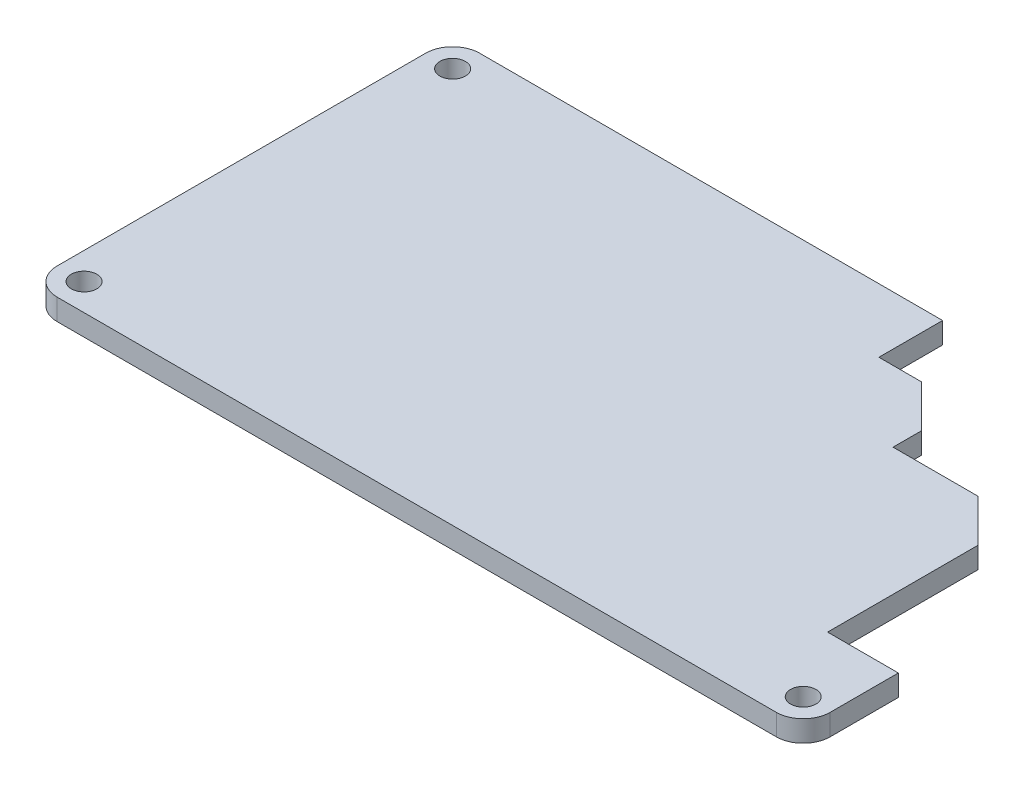
ISO-10303-21;
HEADER;
FILE_DESCRIPTION(('STEP AP214'),'2;1');
FILE_NAME('part.step','',(''),(''),'','','');
FILE_SCHEMA(('AUTOMOTIVE_DESIGN { 1 0 10303 214 1 1 1 1 }'));
ENDSEC;
DATA;
#1=APPLICATION_CONTEXT('core data for automotive mechanical design processes');
#2=APPLICATION_PROTOCOL_DEFINITION('international standard','automotive_design',2000,#1);
#3=PRODUCT_CONTEXT('',#1,'mechanical');
#4=PRODUCT('Part','Part','',(#3));
#5=PRODUCT_RELATED_PRODUCT_CATEGORY('part','',(#4));
#6=PRODUCT_DEFINITION_FORMATION('','',#4);
#7=PRODUCT_DEFINITION_CONTEXT('part definition',#1,'design');
#8=PRODUCT_DEFINITION('design','',#6,#7);
#9=PRODUCT_DEFINITION_SHAPE('','',#8);
#10=(LENGTH_UNIT() NAMED_UNIT(*) SI_UNIT(.MILLI.,.METRE.));
#11=(NAMED_UNIT(*) PLANE_ANGLE_UNIT() SI_UNIT($,.RADIAN.));
#12=(NAMED_UNIT(*) SI_UNIT($,.STERADIAN.) SOLID_ANGLE_UNIT());
#13=UNCERTAINTY_MEASURE_WITH_UNIT(LENGTH_MEASURE(1.E-05),#10,'distance_accuracy_value','');
#14=(GEOMETRIC_REPRESENTATION_CONTEXT(3) GLOBAL_UNCERTAINTY_ASSIGNED_CONTEXT((#13)) GLOBAL_UNIT_ASSIGNED_CONTEXT((#10,
#11,#12)) REPRESENTATION_CONTEXT('',''));
#15=CARTESIAN_POINT('',(0.,0.,0.));
#16=DIRECTION('',(0.,0.,1.));
#17=DIRECTION('',(1.,0.,0.));
#18=AXIS2_PLACEMENT_3D('',#15,#16,#17);
#19=CARTESIAN_POINT('',(0.,3.,-29.844983489967));
#20=DIRECTION('',(0.,0.,1.));
#21=DIRECTION('',(1.,0.,0.));
#22=AXIS2_PLACEMENT_3D('',#19,#20,#21);
#23=PLANE('',#22);
#24=DIRECTION('',(-1.,0.,0.));
#25=VECTOR('',#24,1.);
#26=CARTESIAN_POINT('',(0.,0.,-29.844983489967));
#27=LINE('',#26,#25);
#28=CARTESIAN_POINT('',(14.6100076200153,0.,-29.844983489967));
#29=VERTEX_POINT('',#28);
#30=CARTESIAN_POINT('',(-50.7999999999999,0.,-29.844983489967));
#31=VERTEX_POINT('',#30);
#32=EDGE_CURVE('E167',#29,#31,#27,.T.);
#33=ORIENTED_EDGE('',*,*,#32,.T.);
#34=DIRECTION('',(0.,-1.,0.));
#35=VECTOR('',#34,1.);
#36=CARTESIAN_POINT('',(-50.7999999999999,3.,-29.844983489967));
#37=LINE('',#36,#35);
#38=CARTESIAN_POINT('',(-50.7999999999999,3.,-29.844983489967));
#39=VERTEX_POINT('',#38);
#40=EDGE_CURVE('E150',#39,#31,#37,.T.);
#41=ORIENTED_EDGE('',*,*,#40,.F.);
#42=DIRECTION('',(-1.,0.,0.));
#43=VECTOR('',#42,1.);
#44=CARTESIAN_POINT('',(0.,3.,-29.844983489967));
#45=LINE('',#44,#43);
#46=CARTESIAN_POINT('',(14.6100076200153,3.,-29.844983489967));
#47=VERTEX_POINT('',#46);
#48=EDGE_CURVE('E155',#47,#39,#45,.T.);
#49=ORIENTED_EDGE('',*,*,#48,.F.);
#50=DIRECTION('',(0.,-1.,0.));
#51=VECTOR('',#50,1.);
#52=CARTESIAN_POINT('',(14.6100076200153,3.,-29.844983489967));
#53=LINE('',#52,#51);
#54=EDGE_CURVE('E239',#47,#29,#53,.T.);
#55=ORIENTED_EDGE('',*,*,#54,.T.);
#56=EDGE_LOOP('',(#33,#41,#49,#55));
#57=FACE_BOUND('',#56,.T.);
#58=ADVANCED_FACE('F36',(#57),#23,.F.);
#59=CARTESIAN_POINT('',(-50.7999999999999,3.,-26.0350012700026));
#60=DIRECTION('',(0.,-1.,0.));
#61=DIRECTION('',(0.,0.,-1.));
#62=AXIS2_PLACEMENT_3D('',#59,#60,#61);
#63=CYLINDRICAL_SURFACE('',#62,3.80998221996446);
#64=CARTESIAN_POINT('',(-50.7999999999999,0.,-26.0350012700026));
#65=DIRECTION('',(0.,1.,0.));
#66=DIRECTION('',(0.,0.,1.));
#67=AXIS2_PLACEMENT_3D('',#64,#65,#66);
#68=CIRCLE('',#67,3.80998221996446);
#69=CARTESIAN_POINT('',(-54.6099822199644,0.,-26.0350012700026));
#70=VERTEX_POINT('',#69);
#71=EDGE_CURVE('E216',#31,#70,#68,.T.);
#72=ORIENTED_EDGE('',*,*,#71,.T.);
#73=DIRECTION('',(0.,-1.,0.));
#74=VECTOR('',#73,1.);
#75=CARTESIAN_POINT('',(-54.6099822199644,3.,-26.0350012700026));
#76=LINE('',#75,#74);
#77=CARTESIAN_POINT('',(-54.6099822199644,3.,-26.0350012700026));
#78=VERTEX_POINT('',#77);
#79=EDGE_CURVE('E153',#78,#70,#76,.T.);
#80=ORIENTED_EDGE('',*,*,#79,.F.);
#81=CARTESIAN_POINT('',(-50.7999999999999,3.,-26.0350012700026));
#82=DIRECTION('',(0.,1.,0.));
#83=DIRECTION('',(0.,0.,1.));
#84=AXIS2_PLACEMENT_3D('',#81,#82,#83);
#85=CIRCLE('',#84,3.80998221996446);
#86=EDGE_CURVE('E145',#39,#78,#85,.T.);
#87=ORIENTED_EDGE('',*,*,#86,.F.);
#88=ORIENTED_EDGE('',*,*,#40,.T.);
#89=EDGE_LOOP('',(#72,#80,#87,#88));
#90=FACE_BOUND('',#89,.T.);
#91=ADVANCED_FACE('F148',(#90),#63,.T.);
#92=CARTESIAN_POINT('',(-54.6099822199644,3.,0.));
#93=DIRECTION('',(-1.,0.,0.));
#94=DIRECTION('',(0.,0.,1.));
#95=AXIS2_PLACEMENT_3D('',#92,#93,#94);
#96=PLANE('',#95);
#97=DIRECTION('',(0.,0.,-1.));
#98=VECTOR('',#97,1.);
#99=CARTESIAN_POINT('',(-54.6099822199644,0.,0.));
#100=LINE('',#99,#98);
#101=CARTESIAN_POINT('',(-54.6099822199644,0.,26.0349834899669));
#102=VERTEX_POINT('',#101);
#103=EDGE_CURVE('E212',#102,#70,#100,.T.);
#104=ORIENTED_EDGE('',*,*,#103,.F.);
#105=DIRECTION('',(0.,-1.,0.));
#106=VECTOR('',#105,1.);
#107=CARTESIAN_POINT('',(-54.6099822199644,3.,26.0349834899669));
#108=LINE('',#107,#106);
#109=CARTESIAN_POINT('',(-54.6099822199644,3.,26.0349834899669));
#110=VERTEX_POINT('',#109);
#111=EDGE_CURVE('E11',#102,#110,#108,.F.);
#112=ORIENTED_EDGE('',*,*,#111,.T.);
#113=DIRECTION('',(0.,0.,-1.));
#114=VECTOR('',#113,1.);
#115=CARTESIAN_POINT('',(-54.6099822199644,3.,0.));
#116=LINE('',#115,#114);
#117=EDGE_CURVE('E154',#110,#78,#116,.T.);
#118=ORIENTED_EDGE('',*,*,#117,.T.);
#119=ORIENTED_EDGE('',*,*,#79,.T.);
#120=EDGE_LOOP('',(#104,#112,#118,#119));
#121=FACE_BOUND('',#120,.T.);
#122=ADVANCED_FACE('F287',(#121),#96,.T.);
#123=CARTESIAN_POINT('',(0.,3.,29.8449834899669));
#124=DIRECTION('',(0.,0.,1.));
#125=DIRECTION('',(1.,0.,0.));
#126=AXIS2_PLACEMENT_3D('',#123,#124,#125);
#127=PLANE('',#126);
#128=DIRECTION('',(-1.,0.,0.));
#129=VECTOR('',#128,1.);
#130=CARTESIAN_POINT('',(0.,0.,29.8449834899669));
#131=LINE('',#130,#129);
#132=CARTESIAN_POINT('',(50.7999822199644,0.,29.8449834899669));
#133=VERTEX_POINT('',#132);
#134=CARTESIAN_POINT('',(-50.7999822199644,0.,29.8449834899669));
#135=VERTEX_POINT('',#134);
#136=EDGE_CURVE('E206',#133,#135,#131,.T.);
#137=ORIENTED_EDGE('',*,*,#136,.F.);
#138=DIRECTION('',(0.,-1.,0.));
#139=VECTOR('',#138,1.);
#140=CARTESIAN_POINT('',(50.7999822199644,3.,29.8449834899669));
#141=LINE('',#140,#139);
#142=CARTESIAN_POINT('',(50.7999822199644,3.,29.8449834899669));
#143=VERTEX_POINT('',#142);
#144=EDGE_CURVE('E183',#133,#143,#141,.F.);
#145=ORIENTED_EDGE('',*,*,#144,.T.);
#146=DIRECTION('',(-1.,0.,0.));
#147=VECTOR('',#146,1.);
#148=CARTESIAN_POINT('',(0.,3.,29.8449834899669));
#149=LINE('',#148,#147);
#150=CARTESIAN_POINT('',(-50.7999822199644,3.,29.8449834899669));
#151=VERTEX_POINT('',#150);
#152=EDGE_CURVE('E190',#143,#151,#149,.T.);
#153=ORIENTED_EDGE('',*,*,#152,.T.);
#154=DIRECTION('',(0.,-1.,0.));
#155=VECTOR('',#154,1.);
#156=CARTESIAN_POINT('',(-50.7999822199644,3.,29.8449834899669));
#157=LINE('',#156,#155);
#158=EDGE_CURVE('E180',#151,#135,#157,.T.);
#159=ORIENTED_EDGE('',*,*,#158,.T.);
#160=EDGE_LOOP('',(#137,#145,#153,#159));
#161=FACE_BOUND('',#160,.T.);
#162=ADVANCED_FACE('F210',(#161),#127,.T.);
#163=CARTESIAN_POINT('',(54.6099822199644,3.,0.));
#164=DIRECTION('',(-1.,0.,0.));
#165=DIRECTION('',(0.,0.,1.));
#166=AXIS2_PLACEMENT_3D('',#163,#164,#165);
#167=PLANE('',#166);
#168=DIRECTION('',(0.,0.,-1.));
#169=VECTOR('',#168,1.);
#170=CARTESIAN_POINT('',(54.6099822199644,3.,0.));
#171=LINE('',#170,#169);
#172=CARTESIAN_POINT('',(54.6099822199644,3.,26.0349834899669));
#173=VERTEX_POINT('',#172);
#174=CARTESIAN_POINT('',(54.6099822199644,3.,16.4073153565341));
#175=VERTEX_POINT('',#174);
#176=EDGE_CURVE('E188',#173,#175,#171,.T.);
#177=ORIENTED_EDGE('',*,*,#176,.F.);
#178=DIRECTION('',(0.,-1.,0.));
#179=VECTOR('',#178,1.);
#180=CARTESIAN_POINT('',(54.6099822199644,0.,26.0349834899669));
#181=LINE('',#180,#179);
#182=CARTESIAN_POINT('',(54.6099822199644,0.,26.0349834899669));
#183=VERTEX_POINT('',#182);
#184=EDGE_CURVE('E168',#173,#183,#181,.T.);
#185=ORIENTED_EDGE('',*,*,#184,.T.);
#186=DIRECTION('',(0.,0.,-1.));
#187=VECTOR('',#186,1.);
#188=CARTESIAN_POINT('',(54.6099822199644,0.,0.));
#189=LINE('',#188,#187);
#190=CARTESIAN_POINT('',(54.6099822199644,0.,16.4073153565341));
#191=VERTEX_POINT('',#190);
#192=EDGE_CURVE('E208',#183,#191,#189,.T.);
#193=ORIENTED_EDGE('',*,*,#192,.T.);
#194=DIRECTION('',(0.,-1.,0.));
#195=VECTOR('',#194,1.);
#196=CARTESIAN_POINT('',(54.6099822199644,3.,16.4073153565341));
#197=LINE('',#196,#195);
#198=EDGE_CURVE('E173',#175,#191,#197,.T.);
#199=ORIENTED_EDGE('',*,*,#198,.F.);
#200=EDGE_LOOP('',(#177,#185,#193,#199));
#201=FACE_BOUND('',#200,.T.);
#202=ADVANCED_FACE('F195',(#201),#167,.F.);
#203=CARTESIAN_POINT('',(0.,3.,16.4073153565341));
#204=DIRECTION('',(0.,0.,1.));
#205=DIRECTION('',(1.,0.,0.));
#206=AXIS2_PLACEMENT_3D('',#203,#204,#205);
#207=PLANE('',#206);
#208=DIRECTION('',(-1.,0.,0.));
#209=VECTOR('',#208,1.);
#210=CARTESIAN_POINT('',(0.,0.,16.4073153565341));
#211=LINE('',#210,#209);
#212=CARTESIAN_POINT('',(44.6100076200153,0.,16.4073153565341));
#213=VERTEX_POINT('',#212);
#214=EDGE_CURVE('E214',#191,#213,#211,.T.);
#215=ORIENTED_EDGE('',*,*,#214,.T.);
#216=DIRECTION('',(0.,-1.,0.));
#217=VECTOR('',#216,1.);
#218=CARTESIAN_POINT('',(44.6100076200153,3.,16.4073153565341));
#219=LINE('',#218,#217);
#220=CARTESIAN_POINT('',(44.6100076200153,3.,16.4073153565341));
#221=VERTEX_POINT('',#220);
#222=EDGE_CURVE('E254',#221,#213,#219,.T.);
#223=ORIENTED_EDGE('',*,*,#222,.F.);
#224=DIRECTION('',(-1.,0.,0.));
#225=VECTOR('',#224,1.);
#226=CARTESIAN_POINT('',(0.,3.,16.4073153565341));
#227=LINE('',#226,#225);
#228=EDGE_CURVE('E199',#175,#221,#227,.T.);
#229=ORIENTED_EDGE('',*,*,#228,.F.);
#230=ORIENTED_EDGE('',*,*,#198,.T.);
#231=EDGE_LOOP('',(#215,#223,#229,#230));
#232=FACE_BOUND('',#231,.T.);
#233=ADVANCED_FACE('F257',(#232),#207,.F.);
#234=CARTESIAN_POINT('',(44.6100076200153,3.,0.));
#235=DIRECTION('',(-1.,0.,0.));
#236=DIRECTION('',(0.,0.,1.));
#237=AXIS2_PLACEMENT_3D('',#234,#235,#236);
#238=PLANE('',#237);
#239=DIRECTION('',(0.,0.,-1.));
#240=VECTOR('',#239,1.);
#241=CARTESIAN_POINT('',(44.6100076200153,0.,0.));
#242=LINE('',#241,#240);
#243=CARTESIAN_POINT('',(44.6100076200153,0.,-4.84498348996696));
#244=VERTEX_POINT('',#243);
#245=EDGE_CURVE('E221',#213,#244,#242,.T.);
#246=ORIENTED_EDGE('',*,*,#245,.T.);
#247=DIRECTION('',(0.,-1.,0.));
#248=VECTOR('',#247,1.);
#249=CARTESIAN_POINT('',(44.6100076200153,3.,-4.84498348996696));
#250=LINE('',#249,#248);
#251=CARTESIAN_POINT('',(44.6100076200153,3.,-4.84498348996696));
#252=VERTEX_POINT('',#251);
#253=EDGE_CURVE('E252',#252,#244,#250,.T.);
#254=ORIENTED_EDGE('',*,*,#253,.F.);
#255=DIRECTION('',(0.,0.,-1.));
#256=VECTOR('',#255,1.);
#257=CARTESIAN_POINT('',(44.6100076200153,3.,0.));
#258=LINE('',#257,#256);
#259=EDGE_CURVE('E266',#221,#252,#258,.T.);
#260=ORIENTED_EDGE('',*,*,#259,.F.);
#261=ORIENTED_EDGE('',*,*,#222,.T.);
#262=EDGE_LOOP('',(#246,#254,#260,#261));
#263=FACE_BOUND('',#262,.T.);
#264=ADVANCED_FACE('F263',(#263),#238,.F.);
#265=CARTESIAN_POINT('',(24.7274955549911,3.,-24.7274955549911));
#266=DIRECTION('',(0.707106781186548,0.,-0.707106781186547));
#267=DIRECTION('',(-0.707106781186547,0.,-0.707106781186548));
#268=AXIS2_PLACEMENT_3D('',#265,#266,#267);
#269=PLANE('',#268);
#270=DIRECTION('',(0.707106781186547,0.,0.707106781186548));
#271=VECTOR('',#270,1.);
#272=CARTESIAN_POINT('',(24.7274955549911,0.,-24.7274955549911));
#273=LINE('',#272,#271);
#274=CARTESIAN_POINT('',(38.6100076200153,0.,-10.844983489967));
#275=VERTEX_POINT('',#274);
#276=EDGE_CURVE('E224',#275,#244,#273,.T.);
#277=ORIENTED_EDGE('',*,*,#276,.F.);
#278=DIRECTION('',(0.,-1.,0.));
#279=VECTOR('',#278,1.);
#280=CARTESIAN_POINT('',(38.6100076200153,3.,-10.844983489967));
#281=LINE('',#280,#279);
#282=CARTESIAN_POINT('',(38.6100076200153,3.,-10.844983489967));
#283=VERTEX_POINT('',#282);
#284=EDGE_CURVE('E250',#283,#275,#281,.T.);
#285=ORIENTED_EDGE('',*,*,#284,.F.);
#286=DIRECTION('',(0.707106781186547,0.,0.707106781186548));
#287=VECTOR('',#286,1.);
#288=CARTESIAN_POINT('',(24.7274955549911,3.,-24.7274955549911));
#289=LINE('',#288,#287);
#290=EDGE_CURVE('E268',#283,#252,#289,.T.);
#291=ORIENTED_EDGE('',*,*,#290,.T.);
#292=ORIENTED_EDGE('',*,*,#253,.T.);
#293=EDGE_LOOP('',(#277,#285,#291,#292));
#294=FACE_BOUND('',#293,.T.);
#295=ADVANCED_FACE('F361',(#294),#269,.T.);
#296=CARTESIAN_POINT('',(0.,3.,-10.844983489967));
#297=DIRECTION('',(0.,0.,-1.));
#298=DIRECTION('',(-1.,0.,0.));
#299=AXIS2_PLACEMENT_3D('',#296,#297,#298);
#300=PLANE('',#299);
#301=DIRECTION('',(1.,0.,0.));
#302=VECTOR('',#301,1.);
#303=CARTESIAN_POINT('',(0.,0.,-10.844983489967));
#304=LINE('',#303,#302);
#305=CARTESIAN_POINT('',(26.6100076200153,0.,-10.844983489967));
#306=VERTEX_POINT('',#305);
#307=EDGE_CURVE('E227',#306,#275,#304,.T.);
#308=ORIENTED_EDGE('',*,*,#307,.F.);
#309=DIRECTION('',(0.,-1.,0.));
#310=VECTOR('',#309,1.);
#311=CARTESIAN_POINT('',(26.6100076200153,3.,-10.844983489967));
#312=LINE('',#311,#310);
#313=CARTESIAN_POINT('',(26.6100076200153,3.,-10.844983489967));
#314=VERTEX_POINT('',#313);
#315=EDGE_CURVE('E248',#314,#306,#312,.T.);
#316=ORIENTED_EDGE('',*,*,#315,.F.);
#317=DIRECTION('',(1.,0.,0.));
#318=VECTOR('',#317,1.);
#319=CARTESIAN_POINT('',(0.,3.,-10.844983489967));
#320=LINE('',#319,#318);
#321=EDGE_CURVE('E270',#314,#283,#320,.T.);
#322=ORIENTED_EDGE('',*,*,#321,.T.);
#323=ORIENTED_EDGE('',*,*,#284,.T.);
#324=EDGE_LOOP('',(#308,#316,#322,#323));
#325=FACE_BOUND('',#324,.T.);
#326=ADVANCED_FACE('F357',(#325),#300,.T.);
#327=CARTESIAN_POINT('',(26.6100076200153,3.,0.));
#328=DIRECTION('',(1.,0.,0.));
#329=DIRECTION('',(0.,0.,-1.));
#330=AXIS2_PLACEMENT_3D('',#327,#328,#329);
#331=PLANE('',#330);
#332=DIRECTION('',(0.,0.,1.));
#333=VECTOR('',#332,1.);
#334=CARTESIAN_POINT('',(26.6100076200153,0.,0.));
#335=LINE('',#334,#333);
#336=CARTESIAN_POINT('',(26.6100076200153,0.,-14.844983489967));
#337=VERTEX_POINT('',#336);
#338=EDGE_CURVE('E230',#337,#306,#335,.T.);
#339=ORIENTED_EDGE('',*,*,#338,.F.);
#340=DIRECTION('',(0.,-1.,0.));
#341=VECTOR('',#340,1.);
#342=CARTESIAN_POINT('',(26.6100076200153,3.,-14.844983489967));
#343=LINE('',#342,#341);
#344=CARTESIAN_POINT('',(26.6100076200153,3.,-14.844983489967));
#345=VERTEX_POINT('',#344);
#346=EDGE_CURVE('E246',#345,#337,#343,.T.);
#347=ORIENTED_EDGE('',*,*,#346,.F.);
#348=DIRECTION('',(0.,0.,1.));
#349=VECTOR('',#348,1.);
#350=CARTESIAN_POINT('',(26.6100076200153,3.,0.));
#351=LINE('',#350,#349);
#352=EDGE_CURVE('E276',#345,#314,#351,.T.);
#353=ORIENTED_EDGE('',*,*,#352,.T.);
#354=ORIENTED_EDGE('',*,*,#315,.T.);
#355=EDGE_LOOP('',(#339,#347,#353,#354));
#356=FACE_BOUND('',#355,.T.);
#357=ADVANCED_FACE('F353',(#356),#331,.T.);
#358=CARTESIAN_POINT('',(20.7274955549911,3.,-20.7274955549911));
#359=DIRECTION('',(0.707106781186548,0.,-0.707106781186547));
#360=DIRECTION('',(-0.707106781186547,0.,-0.707106781186548));
#361=AXIS2_PLACEMENT_3D('',#358,#359,#360);
#362=PLANE('',#361);
#363=DIRECTION('',(0.707106781186547,0.,0.707106781186548));
#364=VECTOR('',#363,1.);
#365=CARTESIAN_POINT('',(20.7274955549911,0.,-20.7274955549911));
#366=LINE('',#365,#364);
#367=CARTESIAN_POINT('',(20.6100076200153,0.,-20.844983489967));
#368=VERTEX_POINT('',#367);
#369=EDGE_CURVE('E233',#368,#337,#366,.T.);
#370=ORIENTED_EDGE('',*,*,#369,.F.);
#371=DIRECTION('',(0.,-1.,0.));
#372=VECTOR('',#371,1.);
#373=CARTESIAN_POINT('',(20.6100076200153,3.,-20.844983489967));
#374=LINE('',#373,#372);
#375=CARTESIAN_POINT('',(20.6100076200153,3.,-20.844983489967));
#376=VERTEX_POINT('',#375);
#377=EDGE_CURVE('E244',#376,#368,#374,.T.);
#378=ORIENTED_EDGE('',*,*,#377,.F.);
#379=DIRECTION('',(0.707106781186547,0.,0.707106781186548));
#380=VECTOR('',#379,1.);
#381=CARTESIAN_POINT('',(20.7274955549911,3.,-20.7274955549911));
#382=LINE('',#381,#380);
#383=EDGE_CURVE('E279',#376,#345,#382,.T.);
#384=ORIENTED_EDGE('',*,*,#383,.T.);
#385=ORIENTED_EDGE('',*,*,#346,.T.);
#386=EDGE_LOOP('',(#370,#378,#384,#385));
#387=FACE_BOUND('',#386,.T.);
#388=ADVANCED_FACE('F349',(#387),#362,.T.);
#389=CARTESIAN_POINT('',(0.,3.,-20.8449834899669));
#390=DIRECTION('',(0.,0.,1.));
#391=DIRECTION('',(1.,0.,0.));
#392=AXIS2_PLACEMENT_3D('',#389,#390,#391);
#393=PLANE('',#392);
#394=DIRECTION('',(-1.,0.,0.));
#395=VECTOR('',#394,1.);
#396=CARTESIAN_POINT('',(0.,0.,-20.8449834899669));
#397=LINE('',#396,#395);
#398=CARTESIAN_POINT('',(14.6100076200153,0.,-20.844983489967));
#399=VERTEX_POINT('',#398);
#400=EDGE_CURVE('E236',#368,#399,#397,.T.);
#401=ORIENTED_EDGE('',*,*,#400,.T.);
#402=DIRECTION('',(0.,-1.,0.));
#403=VECTOR('',#402,1.);
#404=CARTESIAN_POINT('',(14.6100076200153,3.,-20.844983489967));
#405=LINE('',#404,#403);
#406=CARTESIAN_POINT('',(14.6100076200153,3.,-20.844983489967));
#407=VERTEX_POINT('',#406);
#408=EDGE_CURVE('E241',#407,#399,#405,.T.);
#409=ORIENTED_EDGE('',*,*,#408,.F.);
#410=DIRECTION('',(-1.,0.,0.));
#411=VECTOR('',#410,1.);
#412=CARTESIAN_POINT('',(0.,3.,-20.8449834899669));
#413=LINE('',#412,#411);
#414=EDGE_CURVE('E282',#376,#407,#413,.T.);
#415=ORIENTED_EDGE('',*,*,#414,.F.);
#416=ORIENTED_EDGE('',*,*,#377,.T.);
#417=EDGE_LOOP('',(#401,#409,#415,#416));
#418=FACE_BOUND('',#417,.T.);
#419=ADVANCED_FACE('F345',(#418),#393,.F.);
#420=CARTESIAN_POINT('',(14.6100076200153,3.,0.));
#421=DIRECTION('',(-1.,0.,0.));
#422=DIRECTION('',(0.,0.,1.));
#423=AXIS2_PLACEMENT_3D('',#420,#421,#422);
#424=PLANE('',#423);
#425=DIRECTION('',(0.,0.,-1.));
#426=VECTOR('',#425,1.);
#427=CARTESIAN_POINT('',(14.6100076200153,0.,0.));
#428=LINE('',#427,#426);
#429=EDGE_CURVE('E164',#399,#29,#428,.T.);
#430=ORIENTED_EDGE('',*,*,#429,.T.);
#431=ORIENTED_EDGE('',*,*,#54,.F.);
#432=DIRECTION('',(0.,0.,-1.));
#433=VECTOR('',#432,1.);
#434=CARTESIAN_POINT('',(14.6100076200153,3.,0.));
#435=LINE('',#434,#433);
#436=EDGE_CURVE('E160',#407,#47,#435,.T.);
#437=ORIENTED_EDGE('',*,*,#436,.F.);
#438=ORIENTED_EDGE('',*,*,#408,.T.);
#439=EDGE_LOOP('',(#430,#431,#437,#438));
#440=FACE_BOUND('',#439,.T.);
#441=ADVANCED_FACE('F338',(#440),#424,.F.);
#442=CARTESIAN_POINT('',(0.,3.,0.));
#443=DIRECTION('',(0.,1.,0.));
#444=DIRECTION('',(0.,0.,1.));
#445=AXIS2_PLACEMENT_3D('',#442,#443,#444);
#446=PLANE('',#445);
#447=CARTESIAN_POINT('',(-50.7999999999999,3.,-26.0350012700026));
#448=DIRECTION('',(0.,1.,0.));
#449=DIRECTION('',(0.,0.,1.));
#450=AXIS2_PLACEMENT_3D('',#447,#448,#449);
#451=CIRCLE('',#450,1.8);
#452=CARTESIAN_POINT('',(-50.7999999999999,3.,-24.2350012700026));
#453=VERTEX_POINT('',#452);
#454=EDGE_CURVE('E302',#453,#453,#451,.T.);
#455=ORIENTED_EDGE('',*,*,#454,.F.);
#456=EDGE_LOOP('',(#455));
#457=FACE_BOUND('',#456,.T.);
#458=CARTESIAN_POINT('',(-50.7999822199644,3.,26.0349834899669));
#459=DIRECTION('',(0.,1.,0.));
#460=DIRECTION('',(0.,0.,1.));
#461=AXIS2_PLACEMENT_3D('',#458,#459,#460);
#462=CIRCLE('',#461,1.8);
#463=CARTESIAN_POINT('',(-50.7999822199644,3.,27.8349834899669));
#464=VERTEX_POINT('',#463);
#465=EDGE_CURVE('E299',#464,#464,#462,.T.);
#466=ORIENTED_EDGE('',*,*,#465,.F.);
#467=EDGE_LOOP('',(#466));
#468=FACE_BOUND('',#467,.T.);
#469=CARTESIAN_POINT('',(50.7999822199644,3.,26.0349834899669));
#470=DIRECTION('',(0.,1.,0.));
#471=DIRECTION('',(0.,0.,1.));
#472=AXIS2_PLACEMENT_3D('',#469,#470,#471);
#473=CIRCLE('',#472,1.8);
#474=CARTESIAN_POINT('',(50.7999822199644,3.,27.8349834899669));
#475=VERTEX_POINT('',#474);
#476=EDGE_CURVE('E293',#475,#475,#473,.T.);
#477=ORIENTED_EDGE('',*,*,#476,.F.);
#478=EDGE_LOOP('',(#477));
#479=FACE_BOUND('',#478,.T.);
#480=ORIENTED_EDGE('',*,*,#152,.F.);
#481=CARTESIAN_POINT('',(50.7999822199644,3.,26.0349834899669));
#482=DIRECTION('',(0.,1.,0.));
#483=DIRECTION('',(0.,0.,1.));
#484=AXIS2_PLACEMENT_3D('',#481,#482,#483);
#485=CIRCLE('',#484,3.81);
#486=EDGE_CURVE('E45',#143,#173,#485,.T.);
#487=ORIENTED_EDGE('',*,*,#486,.T.);
#488=ORIENTED_EDGE('',*,*,#176,.T.);
#489=ORIENTED_EDGE('',*,*,#228,.T.);
#490=ORIENTED_EDGE('',*,*,#259,.T.);
#491=ORIENTED_EDGE('',*,*,#290,.F.);
#492=ORIENTED_EDGE('',*,*,#321,.F.);
#493=ORIENTED_EDGE('',*,*,#352,.F.);
#494=ORIENTED_EDGE('',*,*,#383,.F.);
#495=ORIENTED_EDGE('',*,*,#414,.T.);
#496=ORIENTED_EDGE('',*,*,#436,.T.);
#497=ORIENTED_EDGE('',*,*,#48,.T.);
#498=ORIENTED_EDGE('',*,*,#86,.T.);
#499=ORIENTED_EDGE('',*,*,#117,.F.);
#500=CARTESIAN_POINT('',(-50.7999822199644,3.,26.0349834899669));
#501=DIRECTION('',(0.,1.,0.));
#502=DIRECTION('',(0.,0.,1.));
#503=AXIS2_PLACEMENT_3D('',#500,#501,#502);
#504=CIRCLE('',#503,3.81);
#505=EDGE_CURVE('E57',#110,#151,#504,.T.);
#506=ORIENTED_EDGE('',*,*,#505,.T.);
#507=EDGE_LOOP('',(#480,#487,#488,#489,#490,#491,#492,#493,#494,#495,#496,#497,#498,#499,#506));
#508=FACE_BOUND('',#507,.T.);
#509=ADVANCED_FACE('F158',(#457,#468,#479,#508),#446,.T.);
#510=CARTESIAN_POINT('',(0.,0.,0.));
#511=DIRECTION('',(0.,1.,0.));
#512=DIRECTION('',(0.,0.,1.));
#513=AXIS2_PLACEMENT_3D('',#510,#511,#512);
#514=PLANE('',#513);
#515=CARTESIAN_POINT('',(-50.7999999999999,0.,-26.0350012700026));
#516=DIRECTION('',(0.,1.,0.));
#517=DIRECTION('',(0.,0.,1.));
#518=AXIS2_PLACEMENT_3D('',#515,#516,#517);
#519=CIRCLE('',#518,1.8);
#520=CARTESIAN_POINT('',(-50.7999999999999,0.,-24.2350012700026));
#521=VERTEX_POINT('',#520);
#522=EDGE_CURVE('E40',#521,#521,#519,.T.);
#523=ORIENTED_EDGE('',*,*,#522,.T.);
#524=EDGE_LOOP('',(#523));
#525=FACE_BOUND('',#524,.T.);
#526=CARTESIAN_POINT('',(-50.7999822199644,0.,26.0349834899669));
#527=DIRECTION('',(0.,1.,0.));
#528=DIRECTION('',(0.,0.,1.));
#529=AXIS2_PLACEMENT_3D('',#526,#527,#528);
#530=CIRCLE('',#529,1.8);
#531=CARTESIAN_POINT('',(-50.7999822199644,0.,27.8349834899669));
#532=VERTEX_POINT('',#531);
#533=EDGE_CURVE('E296',#532,#532,#530,.T.);
#534=ORIENTED_EDGE('',*,*,#533,.T.);
#535=EDGE_LOOP('',(#534));
#536=FACE_BOUND('',#535,.T.);
#537=CARTESIAN_POINT('',(50.7999822199644,0.,26.0349834899669));
#538=DIRECTION('',(0.,1.,0.));
#539=DIRECTION('',(0.,0.,1.));
#540=AXIS2_PLACEMENT_3D('',#537,#538,#539);
#541=CIRCLE('',#540,1.8);
#542=CARTESIAN_POINT('',(50.7999822199644,0.,27.8349834899669));
#543=VERTEX_POINT('',#542);
#544=EDGE_CURVE('E285',#543,#543,#541,.T.);
#545=ORIENTED_EDGE('',*,*,#544,.T.);
#546=EDGE_LOOP('',(#545));
#547=FACE_BOUND('',#546,.T.);
#548=ORIENTED_EDGE('',*,*,#192,.F.);
#549=CARTESIAN_POINT('',(50.7999822199644,0.,26.0349834899669));
#550=DIRECTION('',(0.,1.,0.));
#551=DIRECTION('',(0.,0.,1.));
#552=AXIS2_PLACEMENT_3D('',#549,#550,#551);
#553=CIRCLE('',#552,3.81);
#554=EDGE_CURVE('E178',#183,#133,#553,.F.);
#555=ORIENTED_EDGE('',*,*,#554,.T.);
#556=ORIENTED_EDGE('',*,*,#136,.T.);
#557=CARTESIAN_POINT('',(-50.7999822199644,0.,26.0349834899669));
#558=DIRECTION('',(0.,1.,0.));
#559=DIRECTION('',(0.,0.,1.));
#560=AXIS2_PLACEMENT_3D('',#557,#558,#559);
#561=CIRCLE('',#560,3.81);
#562=EDGE_CURVE('E171',#135,#102,#561,.F.);
#563=ORIENTED_EDGE('',*,*,#562,.T.);
#564=ORIENTED_EDGE('',*,*,#103,.T.);
#565=ORIENTED_EDGE('',*,*,#71,.F.);
#566=ORIENTED_EDGE('',*,*,#32,.F.);
#567=ORIENTED_EDGE('',*,*,#429,.F.);
#568=ORIENTED_EDGE('',*,*,#400,.F.);
#569=ORIENTED_EDGE('',*,*,#369,.T.);
#570=ORIENTED_EDGE('',*,*,#338,.T.);
#571=ORIENTED_EDGE('',*,*,#307,.T.);
#572=ORIENTED_EDGE('',*,*,#276,.T.);
#573=ORIENTED_EDGE('',*,*,#245,.F.);
#574=ORIENTED_EDGE('',*,*,#214,.F.);
#575=EDGE_LOOP('',(#548,#555,#556,#563,#564,#565,#566,#567,#568,#569,#570,#571,#572,#573,#574));
#576=FACE_BOUND('',#575,.T.);
#577=ADVANCED_FACE('F205',(#525,#536,#547,#576),#514,.F.);
#578=CARTESIAN_POINT('',(50.7999822199644,3.,26.0349834899669));
#579=DIRECTION('',(0.,1.,0.));
#580=DIRECTION('',(0.,0.,1.));
#581=AXIS2_PLACEMENT_3D('',#578,#579,#580);
#582=CYLINDRICAL_SURFACE('',#581,3.81);
#583=ORIENTED_EDGE('',*,*,#486,.F.);
#584=ORIENTED_EDGE('',*,*,#144,.F.);
#585=ORIENTED_EDGE('',*,*,#554,.F.);
#586=ORIENTED_EDGE('',*,*,#184,.F.);
#587=EDGE_LOOP('',(#583,#584,#585,#586));
#588=FACE_BOUND('',#587,.T.);
#589=ADVANCED_FACE('F201',(#588),#582,.T.);
#590=CARTESIAN_POINT('',(-50.7999822199644,3.,26.0349834899669));
#591=DIRECTION('',(0.,-1.,0.));
#592=DIRECTION('',(0.,0.,-1.));
#593=AXIS2_PLACEMENT_3D('',#590,#591,#592);
#594=CYLINDRICAL_SURFACE('',#593,3.81);
#595=ORIENTED_EDGE('',*,*,#505,.F.);
#596=ORIENTED_EDGE('',*,*,#111,.F.);
#597=ORIENTED_EDGE('',*,*,#562,.F.);
#598=ORIENTED_EDGE('',*,*,#158,.F.);
#599=EDGE_LOOP('',(#595,#596,#597,#598));
#600=FACE_BOUND('',#599,.T.);
#601=ADVANCED_FACE('F38',(#600),#594,.T.);
#602=CARTESIAN_POINT('',(50.7999822199644,3.,26.0349834899669));
#603=DIRECTION('',(0.,1.,0.));
#604=DIRECTION('',(0.,0.,1.));
#605=AXIS2_PLACEMENT_3D('',#602,#603,#604);
#606=CYLINDRICAL_SURFACE('',#605,1.8);
#607=ORIENTED_EDGE('',*,*,#476,.T.);
#608=EDGE_LOOP('',(#607));
#609=FACE_BOUND('',#608,.T.);
#610=ORIENTED_EDGE('',*,*,#544,.F.);
#611=EDGE_LOOP('',(#610));
#612=FACE_BOUND('',#611,.T.);
#613=ADVANCED_FACE('F318',(#609,#612),#606,.F.);
#614=CARTESIAN_POINT('',(-50.7999822199644,3.,26.0349834899669));
#615=DIRECTION('',(0.,1.,0.));
#616=DIRECTION('',(0.,0.,1.));
#617=AXIS2_PLACEMENT_3D('',#614,#615,#616);
#618=CYLINDRICAL_SURFACE('',#617,1.8);
#619=ORIENTED_EDGE('',*,*,#465,.T.);
#620=EDGE_LOOP('',(#619));
#621=FACE_BOUND('',#620,.T.);
#622=ORIENTED_EDGE('',*,*,#533,.F.);
#623=EDGE_LOOP('',(#622));
#624=FACE_BOUND('',#623,.T.);
#625=ADVANCED_FACE('F313',(#621,#624),#618,.F.);
#626=CARTESIAN_POINT('',(-50.7999999999999,3.,-26.0350012700026));
#627=DIRECTION('',(0.,1.,0.));
#628=DIRECTION('',(0.,0.,1.));
#629=AXIS2_PLACEMENT_3D('',#626,#627,#628);
#630=CYLINDRICAL_SURFACE('',#629,1.8);
#631=ORIENTED_EDGE('',*,*,#454,.T.);
#632=EDGE_LOOP('',(#631));
#633=FACE_BOUND('',#632,.T.);
#634=ORIENTED_EDGE('',*,*,#522,.F.);
#635=EDGE_LOOP('',(#634));
#636=FACE_BOUND('',#635,.T.);
#637=ADVANCED_FACE('F311',(#633,#636),#630,.F.);
#638=CLOSED_SHELL('',(#58,#91,#122,#162,#202,#233,#264,#295,#326,#357,#388,#419,#441,#509,#577,
#589,#601,#613,#625,#637));
#639=MANIFOLD_SOLID_BREP('B2',#638);
#640=ADVANCED_BREP_SHAPE_REPRESENTATION('',(#18,#639),#14);
#641=SHAPE_DEFINITION_REPRESENTATION(#9,#640);
ENDSEC;
END-ISO-10303-21;
